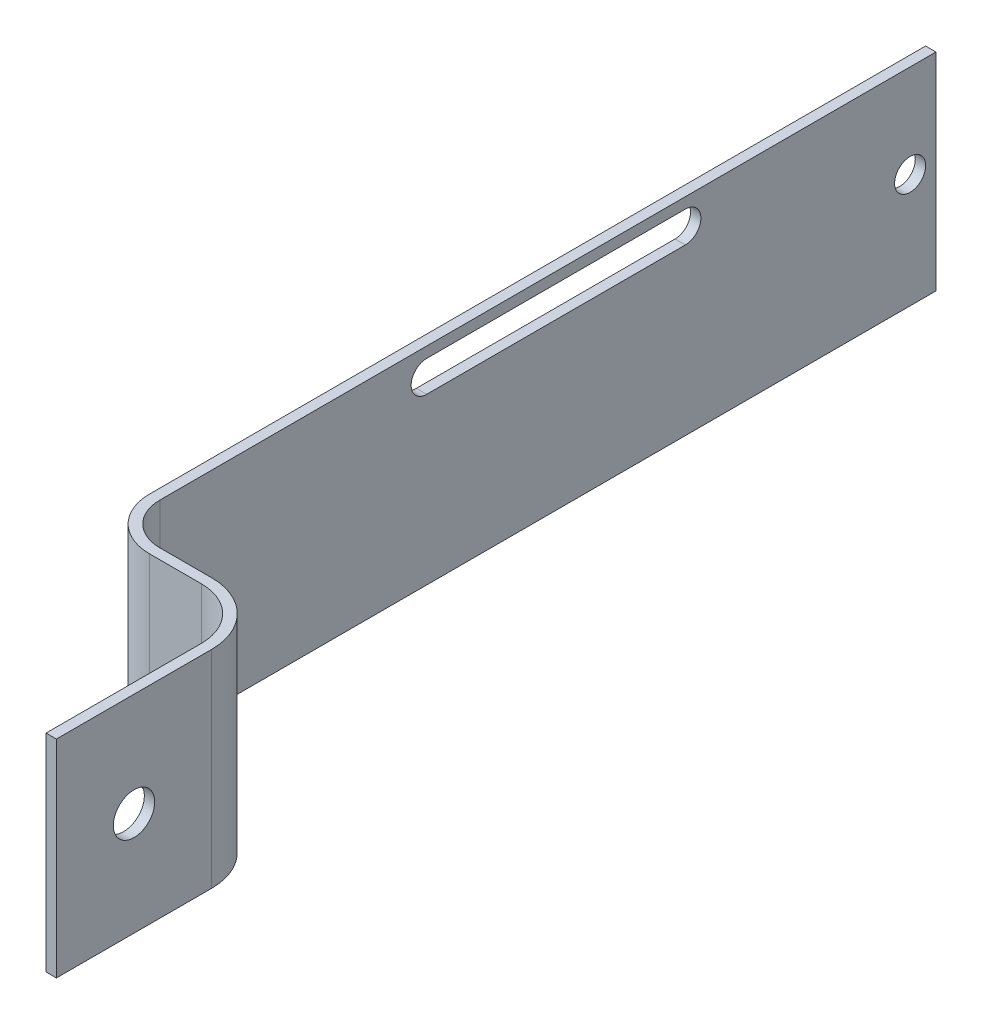
ISO-10303-21;
HEADER;
FILE_DESCRIPTION(('STEP AP214'),'2;1');
FILE_NAME('part.step','',(''),(''),'','','');
FILE_SCHEMA(('AUTOMOTIVE_DESIGN { 1 0 10303 214 1 1 1 1 }'));
ENDSEC;
DATA;
#1=APPLICATION_CONTEXT('core data for automotive mechanical design processes');
#2=APPLICATION_PROTOCOL_DEFINITION('international standard','automotive_design',2000,#1);
#3=PRODUCT_CONTEXT('',#1,'mechanical');
#4=PRODUCT('Part','Part','',(#3));
#5=PRODUCT_RELATED_PRODUCT_CATEGORY('part','',(#4));
#6=PRODUCT_DEFINITION_FORMATION('','',#4);
#7=PRODUCT_DEFINITION_CONTEXT('part definition',#1,'design');
#8=PRODUCT_DEFINITION('design','',#6,#7);
#9=PRODUCT_DEFINITION_SHAPE('','',#8);
#10=(LENGTH_UNIT() NAMED_UNIT(*) SI_UNIT(.MILLI.,.METRE.));
#11=(NAMED_UNIT(*) PLANE_ANGLE_UNIT() SI_UNIT($,.RADIAN.));
#12=(NAMED_UNIT(*) SI_UNIT($,.STERADIAN.) SOLID_ANGLE_UNIT());
#13=UNCERTAINTY_MEASURE_WITH_UNIT(LENGTH_MEASURE(1.E-05),#10,'distance_accuracy_value','');
#14=(GEOMETRIC_REPRESENTATION_CONTEXT(3) GLOBAL_UNCERTAINTY_ASSIGNED_CONTEXT((#13)) GLOBAL_UNIT_ASSIGNED_CONTEXT((#10,
#11,#12)) REPRESENTATION_CONTEXT('',''));
#15=CARTESIAN_POINT('',(0.,0.,0.));
#16=DIRECTION('',(0.,0.,1.));
#17=DIRECTION('',(1.,0.,0.));
#18=AXIS2_PLACEMENT_3D('',#15,#16,#17);
#19=CARTESIAN_POINT('',(-14.,20.,-25.));
#20=DIRECTION('',(-1.,0.,0.));
#21=DIRECTION('',(0.,0.,1.));
#22=AXIS2_PLACEMENT_3D('',#19,#20,#21);
#23=PLANE('',#22);
#24=DIRECTION('',(0.,0.,1.));
#25=VECTOR('',#24,1.);
#26=CARTESIAN_POINT('',(-14.,15.9591232932673,-25.));
#27=LINE('',#26,#25);
#28=CARTESIAN_POINT('',(-14.,15.9591232932674,-75.7833215344252));
#29=VERTEX_POINT('',#28);
#30=CARTESIAN_POINT('',(-14.,15.9591232932674,-50.7833215344252));
#31=VERTEX_POINT('',#30);
#32=EDGE_CURVE('E190',#29,#31,#27,.T.);
#33=ORIENTED_EDGE('',*,*,#32,.T.);
#34=CARTESIAN_POINT('',(-14.,17.4591232932674,-50.7833215344252));
#35=DIRECTION('',(-1.,0.,0.));
#36=DIRECTION('',(0.,0.,1.));
#37=AXIS2_PLACEMENT_3D('',#34,#35,#36);
#38=CIRCLE('',#37,1.5);
#39=CARTESIAN_POINT('',(-14.,18.9591232932674,-50.7833215344252));
#40=VERTEX_POINT('',#39);
#41=EDGE_CURVE('E193',#31,#40,#38,.T.);
#42=ORIENTED_EDGE('',*,*,#41,.T.);
#43=DIRECTION('',(0.,0.,-1.));
#44=VECTOR('',#43,1.);
#45=CARTESIAN_POINT('',(-14.,18.9591232932674,-25.));
#46=LINE('',#45,#44);
#47=CARTESIAN_POINT('',(-14.,18.9591232932674,-75.7833215344252));
#48=VERTEX_POINT('',#47);
#49=EDGE_CURVE('E185',#40,#48,#46,.T.);
#50=ORIENTED_EDGE('',*,*,#49,.T.);
#51=CARTESIAN_POINT('',(-14.,17.4591232932674,-75.7833215344252));
#52=DIRECTION('',(-1.,0.,0.));
#53=DIRECTION('',(0.,0.,1.));
#54=AXIS2_PLACEMENT_3D('',#51,#52,#53);
#55=CIRCLE('',#54,1.5);
#56=EDGE_CURVE('E165',#48,#29,#55,.T.);
#57=ORIENTED_EDGE('',*,*,#56,.T.);
#58=EDGE_LOOP('',(#33,#42,#50,#57));
#59=FACE_BOUND('',#58,.T.);
#60=CARTESIAN_POINT('',(-14.,11.,-97.5));
#61=DIRECTION('',(1.,0.,0.));
#62=DIRECTION('',(0.,0.,-1.));
#63=AXIS2_PLACEMENT_3D('',#60,#61,#62);
#64=CIRCLE('',#63,1.5);
#65=CARTESIAN_POINT('',(-14.,11.,-99.));
#66=VERTEX_POINT('',#65);
#67=EDGE_CURVE('E196',#66,#66,#64,.T.);
#68=ORIENTED_EDGE('',*,*,#67,.F.);
#69=EDGE_LOOP('',(#68));
#70=FACE_BOUND('',#69,.T.);
#71=DIRECTION('',(0.,0.,-1.));
#72=VECTOR('',#71,1.);
#73=CARTESIAN_POINT('',(-14.,0.,-25.));
#74=LINE('',#73,#72);
#75=CARTESIAN_POINT('',(-14.,0.,-25.));
#76=VERTEX_POINT('',#75);
#77=CARTESIAN_POINT('',(-14.,0.,-100.));
#78=VERTEX_POINT('',#77);
#79=EDGE_CURVE('E208',#76,#78,#74,.T.);
#80=ORIENTED_EDGE('',*,*,#79,.T.);
#81=DIRECTION('',(0.,-1.,0.));
#82=VECTOR('',#81,1.);
#83=CARTESIAN_POINT('',(-14.,20.,-100.));
#84=LINE('',#83,#82);
#85=CARTESIAN_POINT('',(-14.,20.,-100.));
#86=VERTEX_POINT('',#85);
#87=EDGE_CURVE('E13',#86,#78,#84,.T.);
#88=ORIENTED_EDGE('',*,*,#87,.F.);
#89=DIRECTION('',(0.,0.,-1.));
#90=VECTOR('',#89,1.);
#91=CARTESIAN_POINT('',(-14.,20.,-25.));
#92=LINE('',#91,#90);
#93=CARTESIAN_POINT('',(-14.,20.,-25.));
#94=VERTEX_POINT('',#93);
#95=EDGE_CURVE('E240',#94,#86,#92,.T.);
#96=ORIENTED_EDGE('',*,*,#95,.F.);
#97=DIRECTION('',(0.,-1.,0.));
#98=VECTOR('',#97,1.);
#99=CARTESIAN_POINT('',(-14.,20.,-25.));
#100=LINE('',#99,#98);
#101=EDGE_CURVE('E271',#94,#76,#100,.T.);
#102=ORIENTED_EDGE('',*,*,#101,.T.);
#103=EDGE_LOOP('',(#80,#88,#96,#102));
#104=FACE_BOUND('',#103,.T.);
#105=ADVANCED_FACE('F48',(#59,#70,#104),#23,.F.);
#106=CARTESIAN_POINT('',(-15.,20.,-100.));
#107=DIRECTION('',(0.,0.,-1.));
#108=DIRECTION('',(-1.,0.,0.));
#109=AXIS2_PLACEMENT_3D('',#106,#107,#108);
#110=PLANE('',#109);
#111=DIRECTION('',(1.,0.,0.));
#112=VECTOR('',#111,1.);
#113=CARTESIAN_POINT('',(-15.,0.,-100.));
#114=LINE('',#113,#112);
#115=CARTESIAN_POINT('',(-15.,0.,-100.));
#116=VERTEX_POINT('',#115);
#117=EDGE_CURVE('E211',#116,#78,#114,.T.);
#118=ORIENTED_EDGE('',*,*,#117,.F.);
#119=DIRECTION('',(0.,-1.,0.));
#120=VECTOR('',#119,1.);
#121=CARTESIAN_POINT('',(-15.,20.,-100.));
#122=LINE('',#121,#120);
#123=CARTESIAN_POINT('',(-15.,20.,-100.));
#124=VERTEX_POINT('',#123);
#125=EDGE_CURVE('E55',#124,#116,#122,.T.);
#126=ORIENTED_EDGE('',*,*,#125,.F.);
#127=DIRECTION('',(1.,0.,0.));
#128=VECTOR('',#127,1.);
#129=CARTESIAN_POINT('',(-15.,20.,-100.));
#130=LINE('',#129,#128);
#131=EDGE_CURVE('E242',#124,#86,#130,.T.);
#132=ORIENTED_EDGE('',*,*,#131,.T.);
#133=ORIENTED_EDGE('',*,*,#87,.T.);
#134=EDGE_LOOP('',(#118,#126,#132,#133));
#135=FACE_BOUND('',#134,.T.);
#136=ADVANCED_FACE('F300',(#135),#110,.T.);
#137=CARTESIAN_POINT('',(-15.,20.,-25.));
#138=DIRECTION('',(-1.,0.,0.));
#139=DIRECTION('',(0.,0.,1.));
#140=AXIS2_PLACEMENT_3D('',#137,#138,#139);
#141=PLANE('',#140);
#142=CARTESIAN_POINT('',(-15.,17.4591232932674,-50.7833215344252));
#143=DIRECTION('',(-1.,0.,0.));
#144=DIRECTION('',(0.,0.,1.));
#145=AXIS2_PLACEMENT_3D('',#142,#143,#144);
#146=CIRCLE('',#145,1.5);
#147=CARTESIAN_POINT('',(-15.,15.9591232932674,-50.7833215344252));
#148=VERTEX_POINT('',#147);
#149=CARTESIAN_POINT('',(-15.,18.9591232932674,-50.7833215344252));
#150=VERTEX_POINT('',#149);
#151=EDGE_CURVE('E70',#148,#150,#146,.T.);
#152=ORIENTED_EDGE('',*,*,#151,.F.);
#153=DIRECTION('',(0.,0.,1.));
#154=VECTOR('',#153,1.);
#155=CARTESIAN_POINT('',(-15.,15.9591232932674,-50.7833215344252));
#156=LINE('',#155,#154);
#157=CARTESIAN_POINT('',(-15.,15.9591232932674,-75.7833215344252));
#158=VERTEX_POINT('',#157);
#159=EDGE_CURVE('E178',#158,#148,#156,.T.);
#160=ORIENTED_EDGE('',*,*,#159,.F.);
#161=CARTESIAN_POINT('',(-15.,17.4591232932674,-75.7833215344252));
#162=DIRECTION('',(-1.,0.,0.));
#163=DIRECTION('',(0.,0.,1.));
#164=AXIS2_PLACEMENT_3D('',#161,#162,#163);
#165=CIRCLE('',#164,1.5);
#166=CARTESIAN_POINT('',(-15.,18.9591232932674,-75.7833215344252));
#167=VERTEX_POINT('',#166);
#168=EDGE_CURVE('E162',#167,#158,#165,.T.);
#169=ORIENTED_EDGE('',*,*,#168,.F.);
#170=DIRECTION('',(0.,0.,-1.));
#171=VECTOR('',#170,1.);
#172=CARTESIAN_POINT('',(-15.,18.9591232932674,-50.7833215344252));
#173=LINE('',#172,#171);
#174=EDGE_CURVE('E171',#150,#167,#173,.T.);
#175=ORIENTED_EDGE('',*,*,#174,.F.);
#176=EDGE_LOOP('',(#152,#160,#169,#175));
#177=FACE_BOUND('',#176,.T.);
#178=CARTESIAN_POINT('',(-15.,11.,-97.5));
#179=DIRECTION('',(1.,0.,0.));
#180=DIRECTION('',(0.,0.,-1.));
#181=AXIS2_PLACEMENT_3D('',#178,#179,#180);
#182=CIRCLE('',#181,1.5);
#183=CARTESIAN_POINT('',(-15.,11.,-99.));
#184=VERTEX_POINT('',#183);
#185=EDGE_CURVE('E199',#184,#184,#182,.T.);
#186=ORIENTED_EDGE('',*,*,#185,.T.);
#187=EDGE_LOOP('',(#186));
#188=FACE_BOUND('',#187,.T.);
#189=DIRECTION('',(0.,0.,-1.));
#190=VECTOR('',#189,1.);
#191=CARTESIAN_POINT('',(-15.,0.,-25.));
#192=LINE('',#191,#190);
#193=CARTESIAN_POINT('',(-15.,0.,-25.));
#194=VERTEX_POINT('',#193);
#195=EDGE_CURVE('E214',#194,#116,#192,.T.);
#196=ORIENTED_EDGE('',*,*,#195,.F.);
#197=DIRECTION('',(0.,-1.,0.));
#198=VECTOR('',#197,1.);
#199=CARTESIAN_POINT('',(-15.,20.,-25.));
#200=LINE('',#199,#198);
#201=CARTESIAN_POINT('',(-15.,20.,-25.));
#202=VERTEX_POINT('',#201);
#203=EDGE_CURVE('E293',#202,#194,#200,.T.);
#204=ORIENTED_EDGE('',*,*,#203,.F.);
#205=DIRECTION('',(0.,0.,-1.));
#206=VECTOR('',#205,1.);
#207=CARTESIAN_POINT('',(-15.,20.,-25.));
#208=LINE('',#207,#206);
#209=EDGE_CURVE('E245',#202,#124,#208,.T.);
#210=ORIENTED_EDGE('',*,*,#209,.T.);
#211=ORIENTED_EDGE('',*,*,#125,.T.);
#212=EDGE_LOOP('',(#196,#204,#210,#211));
#213=FACE_BOUND('',#212,.T.);
#214=ADVANCED_FACE('F175',(#177,#188,#213),#141,.T.);
#215=CARTESIAN_POINT('',(-10.,20.,-25.));
#216=DIRECTION('',(0.,-1.,0.));
#217=DIRECTION('',(0.,0.,-1.));
#218=AXIS2_PLACEMENT_3D('',#215,#216,#217);
#219=CYLINDRICAL_SURFACE('',#218,5.);
#220=CARTESIAN_POINT('',(-10.,0.,-25.));
#221=DIRECTION('',(0.,-1.,0.));
#222=DIRECTION('',(0.,0.,1.));
#223=AXIS2_PLACEMENT_3D('',#220,#221,#222);
#224=CIRCLE('',#223,5.);
#225=CARTESIAN_POINT('',(-9.99999999999996,0.,-20.));
#226=VERTEX_POINT('',#225);
#227=EDGE_CURVE('E217',#226,#194,#224,.T.);
#228=ORIENTED_EDGE('',*,*,#227,.F.);
#229=DIRECTION('',(0.,-1.,0.));
#230=VECTOR('',#229,1.);
#231=CARTESIAN_POINT('',(-9.99999999999996,20.,-20.));
#232=LINE('',#231,#230);
#233=CARTESIAN_POINT('',(-9.99999999999996,20.,-20.));
#234=VERTEX_POINT('',#233);
#235=EDGE_CURVE('E291',#234,#226,#232,.T.);
#236=ORIENTED_EDGE('',*,*,#235,.F.);
#237=CARTESIAN_POINT('',(-10.,20.,-25.));
#238=DIRECTION('',(0.,-1.,0.));
#239=DIRECTION('',(0.,0.,1.));
#240=AXIS2_PLACEMENT_3D('',#237,#238,#239);
#241=CIRCLE('',#240,5.);
#242=EDGE_CURVE('E248',#234,#202,#241,.T.);
#243=ORIENTED_EDGE('',*,*,#242,.T.);
#244=ORIENTED_EDGE('',*,*,#203,.T.);
#245=EDGE_LOOP('',(#228,#236,#243,#244));
#246=FACE_BOUND('',#245,.T.);
#247=ADVANCED_FACE('F308',(#246),#219,.T.);
#248=CARTESIAN_POINT('',(-5.00000000000004,20.,-20.));
#249=DIRECTION('',(0.,0.,1.));
#250=DIRECTION('',(1.,0.,0.));
#251=AXIS2_PLACEMENT_3D('',#248,#249,#250);
#252=PLANE('',#251);
#253=DIRECTION('',(-1.,0.,0.));
#254=VECTOR('',#253,1.);
#255=CARTESIAN_POINT('',(-5.00000000000004,0.,-20.));
#256=LINE('',#255,#254);
#257=CARTESIAN_POINT('',(-5.00000000000003,0.,-20.));
#258=VERTEX_POINT('',#257);
#259=EDGE_CURVE('E220',#258,#226,#256,.T.);
#260=ORIENTED_EDGE('',*,*,#259,.F.);
#261=DIRECTION('',(0.,-1.,0.));
#262=VECTOR('',#261,1.);
#263=CARTESIAN_POINT('',(-5.00000000000003,20.,-20.));
#264=LINE('',#263,#262);
#265=CARTESIAN_POINT('',(-5.00000000000003,20.,-20.));
#266=VERTEX_POINT('',#265);
#267=EDGE_CURVE('E289',#266,#258,#264,.T.);
#268=ORIENTED_EDGE('',*,*,#267,.F.);
#269=DIRECTION('',(-1.,0.,0.));
#270=VECTOR('',#269,1.);
#271=CARTESIAN_POINT('',(-5.00000000000004,20.,-20.));
#272=LINE('',#271,#270);
#273=EDGE_CURVE('E251',#266,#234,#272,.T.);
#274=ORIENTED_EDGE('',*,*,#273,.T.);
#275=ORIENTED_EDGE('',*,*,#235,.T.);
#276=EDGE_LOOP('',(#260,#268,#274,#275));
#277=FACE_BOUND('',#276,.T.);
#278=ADVANCED_FACE('F347',(#277),#252,.T.);
#279=CARTESIAN_POINT('',(-5.,20.,-15.));
#280=DIRECTION('',(0.,-1.,0.));
#281=DIRECTION('',(0.,0.,-1.));
#282=AXIS2_PLACEMENT_3D('',#279,#280,#281);
#283=CYLINDRICAL_SURFACE('',#282,5.);
#284=CARTESIAN_POINT('',(-5.,0.,-15.));
#285=DIRECTION('',(0.,1.,0.));
#286=DIRECTION('',(0.,0.,1.));
#287=AXIS2_PLACEMENT_3D('',#284,#285,#286);
#288=CIRCLE('',#287,5.);
#289=CARTESIAN_POINT('',(0.,0.,-15.));
#290=VERTEX_POINT('',#289);
#291=EDGE_CURVE('E223',#290,#258,#288,.T.);
#292=ORIENTED_EDGE('',*,*,#291,.F.);
#293=DIRECTION('',(0.,-1.,0.));
#294=VECTOR('',#293,1.);
#295=CARTESIAN_POINT('',(0.,20.,-15.));
#296=LINE('',#295,#294);
#297=CARTESIAN_POINT('',(0.,20.,-15.));
#298=VERTEX_POINT('',#297);
#299=EDGE_CURVE('E287',#298,#290,#296,.T.);
#300=ORIENTED_EDGE('',*,*,#299,.F.);
#301=CARTESIAN_POINT('',(-5.,20.,-15.));
#302=DIRECTION('',(0.,1.,0.));
#303=DIRECTION('',(0.,0.,1.));
#304=AXIS2_PLACEMENT_3D('',#301,#302,#303);
#305=CIRCLE('',#304,5.);
#306=EDGE_CURVE('E254',#298,#266,#305,.T.);
#307=ORIENTED_EDGE('',*,*,#306,.T.);
#308=ORIENTED_EDGE('',*,*,#267,.T.);
#309=EDGE_LOOP('',(#292,#300,#307,#308));
#310=FACE_BOUND('',#309,.T.);
#311=ADVANCED_FACE('F344',(#310),#283,.F.);
#312=CARTESIAN_POINT('',(0.,20.,0.));
#313=DIRECTION('',(-1.,0.,0.));
#314=DIRECTION('',(0.,0.,1.));
#315=AXIS2_PLACEMENT_3D('',#312,#313,#314);
#316=PLANE('',#315);
#317=CARTESIAN_POINT('',(0.,10.,-7.49999999999998));
#318=DIRECTION('',(-1.,0.,0.));
#319=DIRECTION('',(0.,0.,1.));
#320=AXIS2_PLACEMENT_3D('',#317,#318,#319);
#321=CIRCLE('',#320,2.);
#322=CARTESIAN_POINT('',(0.,10.,-5.49999999999998));
#323=VERTEX_POINT('',#322);
#324=EDGE_CURVE('E205',#323,#323,#321,.T.);
#325=ORIENTED_EDGE('',*,*,#324,.F.);
#326=EDGE_LOOP('',(#325));
#327=FACE_BOUND('',#326,.T.);
#328=DIRECTION('',(0.,0.,-1.));
#329=VECTOR('',#328,1.);
#330=CARTESIAN_POINT('',(0.,0.,0.));
#331=LINE('',#330,#329);
#332=CARTESIAN_POINT('',(0.,0.,0.));
#333=VERTEX_POINT('',#332);
#334=EDGE_CURVE('E226',#333,#290,#331,.T.);
#335=ORIENTED_EDGE('',*,*,#334,.F.);
#336=DIRECTION('',(0.,-1.,0.));
#337=VECTOR('',#336,1.);
#338=CARTESIAN_POINT('',(0.,20.,0.));
#339=LINE('',#338,#337);
#340=CARTESIAN_POINT('',(0.,20.,0.));
#341=VERTEX_POINT('',#340);
#342=EDGE_CURVE('E285',#341,#333,#339,.T.);
#343=ORIENTED_EDGE('',*,*,#342,.F.);
#344=DIRECTION('',(0.,0.,-1.));
#345=VECTOR('',#344,1.);
#346=CARTESIAN_POINT('',(0.,20.,0.));
#347=LINE('',#346,#345);
#348=EDGE_CURVE('E257',#341,#298,#347,.T.);
#349=ORIENTED_EDGE('',*,*,#348,.T.);
#350=ORIENTED_EDGE('',*,*,#299,.T.);
#351=EDGE_LOOP('',(#335,#343,#349,#350));
#352=FACE_BOUND('',#351,.T.);
#353=ADVANCED_FACE('F341',(#327,#352),#316,.T.);
#354=CARTESIAN_POINT('',(1.,20.,0.));
#355=DIRECTION('',(0.,0.,1.));
#356=DIRECTION('',(1.,0.,0.));
#357=AXIS2_PLACEMENT_3D('',#354,#355,#356);
#358=PLANE('',#357);
#359=DIRECTION('',(-1.,0.,0.));
#360=VECTOR('',#359,1.);
#361=CARTESIAN_POINT('',(1.,0.,0.));
#362=LINE('',#361,#360);
#363=CARTESIAN_POINT('',(1.,0.,0.));
#364=VERTEX_POINT('',#363);
#365=EDGE_CURVE('E229',#364,#333,#362,.T.);
#366=ORIENTED_EDGE('',*,*,#365,.F.);
#367=DIRECTION('',(0.,-1.,0.));
#368=VECTOR('',#367,1.);
#369=CARTESIAN_POINT('',(1.,20.,0.));
#370=LINE('',#369,#368);
#371=CARTESIAN_POINT('',(1.,20.,0.));
#372=VERTEX_POINT('',#371);
#373=EDGE_CURVE('E283',#372,#364,#370,.T.);
#374=ORIENTED_EDGE('',*,*,#373,.F.);
#375=DIRECTION('',(-1.,0.,0.));
#376=VECTOR('',#375,1.);
#377=CARTESIAN_POINT('',(1.,20.,0.));
#378=LINE('',#377,#376);
#379=EDGE_CURVE('E260',#372,#341,#378,.T.);
#380=ORIENTED_EDGE('',*,*,#379,.T.);
#381=ORIENTED_EDGE('',*,*,#342,.T.);
#382=EDGE_LOOP('',(#366,#374,#380,#381));
#383=FACE_BOUND('',#382,.T.);
#384=ADVANCED_FACE('F335',(#383),#358,.T.);
#385=CARTESIAN_POINT('',(1.,20.,0.));
#386=DIRECTION('',(-1.,0.,0.));
#387=DIRECTION('',(0.,0.,1.));
#388=AXIS2_PLACEMENT_3D('',#385,#386,#387);
#389=PLANE('',#388);
#390=CARTESIAN_POINT('',(1.,10.,-7.49999999999998));
#391=DIRECTION('',(1.,0.,0.));
#392=DIRECTION('',(0.,0.,-1.));
#393=AXIS2_PLACEMENT_3D('',#390,#391,#392);
#394=CIRCLE('',#393,2.);
#395=CARTESIAN_POINT('',(1.,10.,-9.49999999999998));
#396=VERTEX_POINT('',#395);
#397=EDGE_CURVE('E202',#396,#396,#394,.T.);
#398=ORIENTED_EDGE('',*,*,#397,.F.);
#399=EDGE_LOOP('',(#398));
#400=FACE_BOUND('',#399,.T.);
#401=DIRECTION('',(0.,0.,-1.));
#402=VECTOR('',#401,1.);
#403=CARTESIAN_POINT('',(1.,0.,0.));
#404=LINE('',#403,#402);
#405=CARTESIAN_POINT('',(1.,0.,-15.));
#406=VERTEX_POINT('',#405);
#407=EDGE_CURVE('E232',#364,#406,#404,.T.);
#408=ORIENTED_EDGE('',*,*,#407,.T.);
#409=DIRECTION('',(0.,-1.,0.));
#410=VECTOR('',#409,1.);
#411=CARTESIAN_POINT('',(1.,20.,-15.));
#412=LINE('',#411,#410);
#413=CARTESIAN_POINT('',(1.,20.,-15.));
#414=VERTEX_POINT('',#413);
#415=EDGE_CURVE('E280',#414,#406,#412,.T.);
#416=ORIENTED_EDGE('',*,*,#415,.F.);
#417=DIRECTION('',(0.,0.,-1.));
#418=VECTOR('',#417,1.);
#419=CARTESIAN_POINT('',(1.,20.,0.));
#420=LINE('',#419,#418);
#421=EDGE_CURVE('E263',#372,#414,#420,.T.);
#422=ORIENTED_EDGE('',*,*,#421,.F.);
#423=ORIENTED_EDGE('',*,*,#373,.T.);
#424=EDGE_LOOP('',(#408,#416,#422,#423));
#425=FACE_BOUND('',#424,.T.);
#426=ADVANCED_FACE('F348',(#400,#425),#389,.F.);
#427=CARTESIAN_POINT('',(-5.,20.,-15.));
#428=DIRECTION('',(0.,-1.,0.));
#429=DIRECTION('',(0.,0.,-1.));
#430=AXIS2_PLACEMENT_3D('',#427,#428,#429);
#431=CYLINDRICAL_SURFACE('',#430,6.);
#432=CARTESIAN_POINT('',(-5.,0.,-15.));
#433=DIRECTION('',(0.,1.,0.));
#434=DIRECTION('',(1.,0.,0.));
#435=AXIS2_PLACEMENT_3D('',#432,#433,#434);
#436=CIRCLE('',#435,6.);
#437=CARTESIAN_POINT('',(-5.00000000000003,0.,-21.));
#438=VERTEX_POINT('',#437);
#439=EDGE_CURVE('E234',#406,#438,#436,.T.);
#440=ORIENTED_EDGE('',*,*,#439,.T.);
#441=DIRECTION('',(0.,-1.,0.));
#442=VECTOR('',#441,1.);
#443=CARTESIAN_POINT('',(-5.00000000000003,20.,-21.));
#444=LINE('',#443,#442);
#445=CARTESIAN_POINT('',(-5.00000000000003,20.,-21.));
#446=VERTEX_POINT('',#445);
#447=EDGE_CURVE('E277',#446,#438,#444,.T.);
#448=ORIENTED_EDGE('',*,*,#447,.F.);
#449=CARTESIAN_POINT('',(-5.,20.,-15.));
#450=DIRECTION('',(0.,1.,0.));
#451=DIRECTION('',(1.,0.,0.));
#452=AXIS2_PLACEMENT_3D('',#449,#450,#451);
#453=CIRCLE('',#452,6.);
#454=EDGE_CURVE('E265',#414,#446,#453,.T.);
#455=ORIENTED_EDGE('',*,*,#454,.F.);
#456=ORIENTED_EDGE('',*,*,#415,.T.);
#457=EDGE_LOOP('',(#440,#448,#455,#456));
#458=FACE_BOUND('',#457,.T.);
#459=ADVANCED_FACE('F329',(#458),#431,.T.);
#460=CARTESIAN_POINT('',(-5.00000000000004,20.,-21.));
#461=DIRECTION('',(0.,0.,1.));
#462=DIRECTION('',(1.,0.,0.));
#463=AXIS2_PLACEMENT_3D('',#460,#461,#462);
#464=PLANE('',#463);
#465=DIRECTION('',(1.,0.,0.));
#466=VECTOR('',#465,1.);
#467=CARTESIAN_POINT('',(-5.00000000000004,0.,-21.));
#468=LINE('',#467,#466);
#469=CARTESIAN_POINT('',(-9.99999999999997,0.,-21.));
#470=VERTEX_POINT('',#469);
#471=EDGE_CURVE('E236',#438,#470,#468,.F.);
#472=ORIENTED_EDGE('',*,*,#471,.T.);
#473=DIRECTION('',(0.,-1.,0.));
#474=VECTOR('',#473,1.);
#475=CARTESIAN_POINT('',(-9.99999999999997,20.,-21.));
#476=LINE('',#475,#474);
#477=CARTESIAN_POINT('',(-9.99999999999997,20.,-21.));
#478=VERTEX_POINT('',#477);
#479=EDGE_CURVE('E274',#478,#470,#476,.T.);
#480=ORIENTED_EDGE('',*,*,#479,.F.);
#481=DIRECTION('',(1.,0.,0.));
#482=VECTOR('',#481,1.);
#483=CARTESIAN_POINT('',(-5.00000000000004,20.,-21.));
#484=LINE('',#483,#482);
#485=EDGE_CURVE('E267',#446,#478,#484,.F.);
#486=ORIENTED_EDGE('',*,*,#485,.F.);
#487=ORIENTED_EDGE('',*,*,#447,.T.);
#488=EDGE_LOOP('',(#472,#480,#486,#487));
#489=FACE_BOUND('',#488,.T.);
#490=ADVANCED_FACE('F325',(#489),#464,.F.);
#491=CARTESIAN_POINT('',(-10.,20.,-25.));
#492=DIRECTION('',(0.,-1.,0.));
#493=DIRECTION('',(0.,0.,-1.));
#494=AXIS2_PLACEMENT_3D('',#491,#492,#493);
#495=CYLINDRICAL_SURFACE('',#494,4.);
#496=CARTESIAN_POINT('',(-10.,0.,-25.));
#497=DIRECTION('',(0.,1.,0.));
#498=DIRECTION('',(1.,0.,0.));
#499=AXIS2_PLACEMENT_3D('',#496,#497,#498);
#500=CIRCLE('',#499,4.);
#501=EDGE_CURVE('E238',#470,#76,#500,.F.);
#502=ORIENTED_EDGE('',*,*,#501,.T.);
#503=ORIENTED_EDGE('',*,*,#101,.F.);
#504=CARTESIAN_POINT('',(-10.,20.,-25.));
#505=DIRECTION('',(0.,1.,0.));
#506=DIRECTION('',(1.,0.,0.));
#507=AXIS2_PLACEMENT_3D('',#504,#505,#506);
#508=CIRCLE('',#507,4.);
#509=EDGE_CURVE('E269',#478,#94,#508,.F.);
#510=ORIENTED_EDGE('',*,*,#509,.F.);
#511=ORIENTED_EDGE('',*,*,#479,.T.);
#512=EDGE_LOOP('',(#502,#503,#510,#511));
#513=FACE_BOUND('',#512,.T.);
#514=ADVANCED_FACE('F321',(#513),#495,.F.);
#515=CARTESIAN_POINT('',(-10.,20.,-25.));
#516=DIRECTION('',(0.,-1.,0.));
#517=DIRECTION('',(0.,0.,-1.));
#518=AXIS2_PLACEMENT_3D('',#515,#516,#517);
#519=PLANE('',#518);
#520=ORIENTED_EDGE('',*,*,#95,.T.);
#521=ORIENTED_EDGE('',*,*,#131,.F.);
#522=ORIENTED_EDGE('',*,*,#209,.F.);
#523=ORIENTED_EDGE('',*,*,#242,.F.);
#524=ORIENTED_EDGE('',*,*,#273,.F.);
#525=ORIENTED_EDGE('',*,*,#306,.F.);
#526=ORIENTED_EDGE('',*,*,#348,.F.);
#527=ORIENTED_EDGE('',*,*,#379,.F.);
#528=ORIENTED_EDGE('',*,*,#421,.T.);
#529=ORIENTED_EDGE('',*,*,#454,.T.);
#530=ORIENTED_EDGE('',*,*,#485,.T.);
#531=ORIENTED_EDGE('',*,*,#509,.T.);
#532=EDGE_LOOP('',(#520,#521,#522,#523,#524,#525,#526,#527,#528,#529,#530,#531));
#533=FACE_BOUND('',#532,.T.);
#534=ADVANCED_FACE('F311',(#533),#519,.F.);
#535=CARTESIAN_POINT('',(-10.,0.,-25.));
#536=DIRECTION('',(0.,-1.,0.));
#537=DIRECTION('',(0.,0.,-1.));
#538=AXIS2_PLACEMENT_3D('',#535,#536,#537);
#539=PLANE('',#538);
#540=ORIENTED_EDGE('',*,*,#79,.F.);
#541=ORIENTED_EDGE('',*,*,#501,.F.);
#542=ORIENTED_EDGE('',*,*,#471,.F.);
#543=ORIENTED_EDGE('',*,*,#439,.F.);
#544=ORIENTED_EDGE('',*,*,#407,.F.);
#545=ORIENTED_EDGE('',*,*,#365,.T.);
#546=ORIENTED_EDGE('',*,*,#334,.T.);
#547=ORIENTED_EDGE('',*,*,#291,.T.);
#548=ORIENTED_EDGE('',*,*,#259,.T.);
#549=ORIENTED_EDGE('',*,*,#227,.T.);
#550=ORIENTED_EDGE('',*,*,#195,.T.);
#551=ORIENTED_EDGE('',*,*,#117,.T.);
#552=EDGE_LOOP('',(#540,#541,#542,#543,#544,#545,#546,#547,#548,#549,#550,#551));
#553=FACE_BOUND('',#552,.T.);
#554=ADVANCED_FACE('F304',(#553),#539,.T.);
#555=CARTESIAN_POINT('',(-15.,10.,-7.49999999999998));
#556=DIRECTION('',(1.,0.,0.));
#557=DIRECTION('',(0.,0.,-1.));
#558=AXIS2_PLACEMENT_3D('',#555,#556,#557);
#559=CYLINDRICAL_SURFACE('',#558,2.);
#560=ORIENTED_EDGE('',*,*,#324,.T.);
#561=EDGE_LOOP('',(#560));
#562=FACE_BOUND('',#561,.T.);
#563=ORIENTED_EDGE('',*,*,#397,.T.);
#564=EDGE_LOOP('',(#563));
#565=FACE_BOUND('',#564,.T.);
#566=ADVANCED_FACE('F370',(#562,#565),#559,.F.);
#567=CARTESIAN_POINT('',(-15.,11.,-97.5));
#568=DIRECTION('',(1.,0.,0.));
#569=DIRECTION('',(0.,0.,-1.));
#570=AXIS2_PLACEMENT_3D('',#567,#568,#569);
#571=CYLINDRICAL_SURFACE('',#570,1.5);
#572=ORIENTED_EDGE('',*,*,#185,.F.);
#573=EDGE_LOOP('',(#572));
#574=FACE_BOUND('',#573,.T.);
#575=ORIENTED_EDGE('',*,*,#67,.T.);
#576=EDGE_LOOP('',(#575));
#577=FACE_BOUND('',#576,.T.);
#578=ADVANCED_FACE('F367',(#574,#577),#571,.F.);
#579=CARTESIAN_POINT('',(1.,17.4591232932674,-50.7833215344252));
#580=DIRECTION('',(-1.,0.,0.));
#581=DIRECTION('',(0.,0.,1.));
#582=AXIS2_PLACEMENT_3D('',#579,#580,#581);
#583=CYLINDRICAL_SURFACE('',#582,1.5);
#584=DIRECTION('',(-1.,0.,0.));
#585=VECTOR('',#584,1.);
#586=CARTESIAN_POINT('',(1.,15.9591232932674,-50.7833215344252));
#587=LINE('',#586,#585);
#588=EDGE_CURVE('E183',#31,#148,#587,.T.);
#589=ORIENTED_EDGE('',*,*,#588,.T.);
#590=ORIENTED_EDGE('',*,*,#151,.T.);
#591=DIRECTION('',(-1.,0.,0.));
#592=VECTOR('',#591,1.);
#593=CARTESIAN_POINT('',(1.,18.9591232932674,-50.7833215344252));
#594=LINE('',#593,#592);
#595=EDGE_CURVE('E168',#40,#150,#594,.T.);
#596=ORIENTED_EDGE('',*,*,#595,.F.);
#597=ORIENTED_EDGE('',*,*,#41,.F.);
#598=EDGE_LOOP('',(#589,#590,#596,#597));
#599=FACE_BOUND('',#598,.T.);
#600=ADVANCED_FACE('F369',(#599),#583,.F.);
#601=CARTESIAN_POINT('',(1.,15.9591232932674,-50.7833215344252));
#602=DIRECTION('',(0.,-1.,0.));
#603=DIRECTION('',(0.,0.,-1.));
#604=AXIS2_PLACEMENT_3D('',#601,#602,#603);
#605=PLANE('',#604);
#606=DIRECTION('',(-1.,0.,0.));
#607=VECTOR('',#606,1.);
#608=CARTESIAN_POINT('',(1.,15.9591232932674,-75.7833215344252));
#609=LINE('',#608,#607);
#610=EDGE_CURVE('E167',#29,#158,#609,.T.);
#611=ORIENTED_EDGE('',*,*,#610,.T.);
#612=ORIENTED_EDGE('',*,*,#159,.T.);
#613=ORIENTED_EDGE('',*,*,#588,.F.);
#614=ORIENTED_EDGE('',*,*,#32,.F.);
#615=EDGE_LOOP('',(#611,#612,#613,#614));
#616=FACE_BOUND('',#615,.T.);
#617=ADVANCED_FACE('F377',(#616),#605,.F.);
#618=CARTESIAN_POINT('',(1.,17.4591232932674,-75.7833215344252));
#619=DIRECTION('',(-1.,0.,0.));
#620=DIRECTION('',(0.,0.,1.));
#621=AXIS2_PLACEMENT_3D('',#618,#619,#620);
#622=CYLINDRICAL_SURFACE('',#621,1.5);
#623=DIRECTION('',(-1.,0.,0.));
#624=VECTOR('',#623,1.);
#625=CARTESIAN_POINT('',(1.,18.9591232932674,-75.7833215344252));
#626=LINE('',#625,#624);
#627=EDGE_CURVE('E62',#48,#167,#626,.T.);
#628=ORIENTED_EDGE('',*,*,#627,.T.);
#629=ORIENTED_EDGE('',*,*,#168,.T.);
#630=ORIENTED_EDGE('',*,*,#610,.F.);
#631=ORIENTED_EDGE('',*,*,#56,.F.);
#632=EDGE_LOOP('',(#628,#629,#630,#631));
#633=FACE_BOUND('',#632,.T.);
#634=ADVANCED_FACE('F159',(#633),#622,.F.);
#635=CARTESIAN_POINT('',(1.,18.9591232932674,-50.7833215344252));
#636=DIRECTION('',(0.,1.,0.));
#637=DIRECTION('',(0.,0.,1.));
#638=AXIS2_PLACEMENT_3D('',#635,#636,#637);
#639=PLANE('',#638);
#640=ORIENTED_EDGE('',*,*,#595,.T.);
#641=ORIENTED_EDGE('',*,*,#174,.T.);
#642=ORIENTED_EDGE('',*,*,#627,.F.);
#643=ORIENTED_EDGE('',*,*,#49,.F.);
#644=EDGE_LOOP('',(#640,#641,#642,#643));
#645=FACE_BOUND('',#644,.T.);
#646=ADVANCED_FACE('F172',(#645),#639,.F.);
#647=CLOSED_SHELL('',(#105,#136,#214,#247,#278,#311,#353,#384,#426,#459,#490,#514,#534,#554,
#566,#578,#600,#617,#634,#646));
#648=MANIFOLD_SOLID_BREP('B2',#647);
#649=ADVANCED_BREP_SHAPE_REPRESENTATION('',(#18,#648),#14);
#650=SHAPE_DEFINITION_REPRESENTATION(#9,#649);
ENDSEC;
END-ISO-10303-21;
